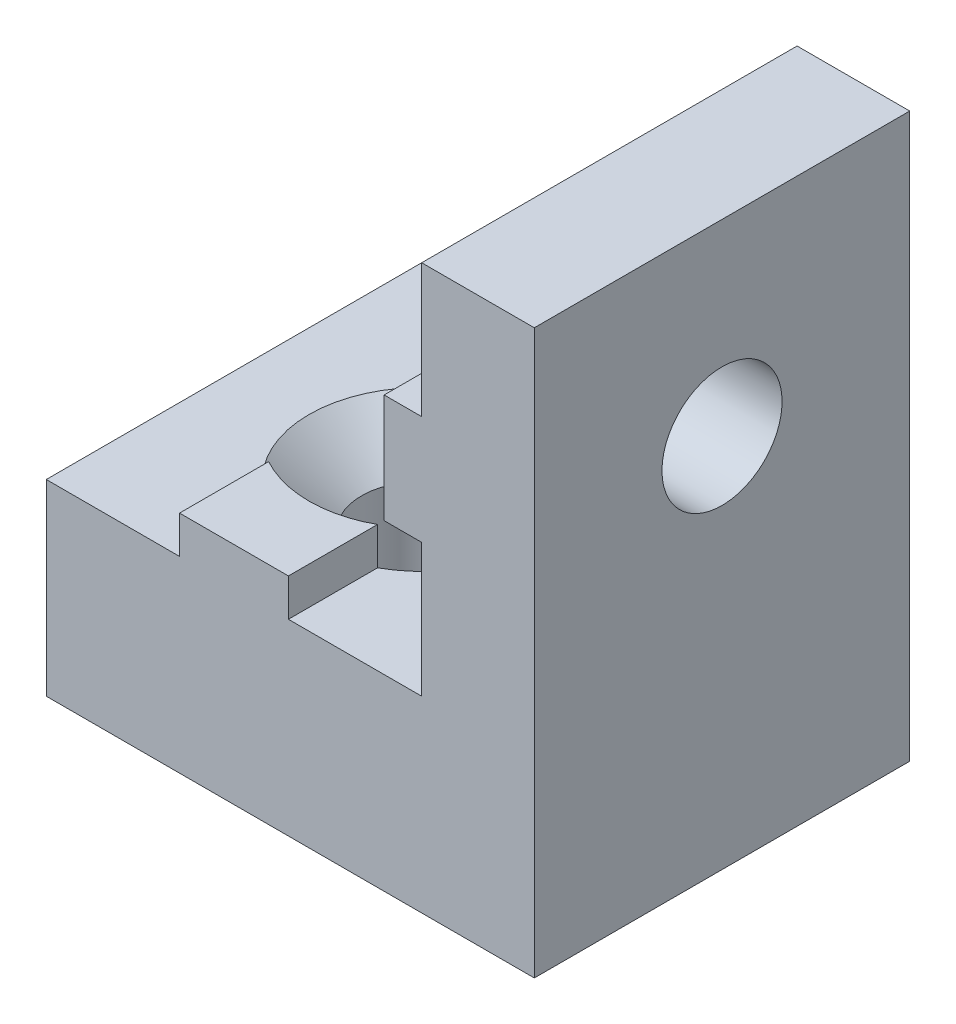
ISO-10303-21;
HEADER;
FILE_DESCRIPTION(('STEP AP214'),'2;1');
FILE_NAME('part.step','',(''),(''),'','','');
FILE_SCHEMA(('AUTOMOTIVE_DESIGN { 1 0 10303 214 1 1 1 1 }'));
ENDSEC;
DATA;
#1=APPLICATION_CONTEXT('core data for automotive mechanical design processes');
#2=APPLICATION_PROTOCOL_DEFINITION('international standard','automotive_design',2000,#1);
#3=PRODUCT_CONTEXT('',#1,'mechanical');
#4=PRODUCT('Part','Part','',(#3));
#5=PRODUCT_RELATED_PRODUCT_CATEGORY('part','',(#4));
#6=PRODUCT_DEFINITION_FORMATION('','',#4);
#7=PRODUCT_DEFINITION_CONTEXT('part definition',#1,'design');
#8=PRODUCT_DEFINITION('design','',#6,#7);
#9=PRODUCT_DEFINITION_SHAPE('','',#8);
#10=(LENGTH_UNIT() NAMED_UNIT(*) SI_UNIT(.MILLI.,.METRE.));
#11=(NAMED_UNIT(*) PLANE_ANGLE_UNIT() SI_UNIT($,.RADIAN.));
#12=(NAMED_UNIT(*) SI_UNIT($,.STERADIAN.) SOLID_ANGLE_UNIT());
#13=UNCERTAINTY_MEASURE_WITH_UNIT(LENGTH_MEASURE(1.E-05),#10,'distance_accuracy_value','');
#14=(GEOMETRIC_REPRESENTATION_CONTEXT(3) GLOBAL_UNCERTAINTY_ASSIGNED_CONTEXT((#13)) GLOBAL_UNIT_ASSIGNED_CONTEXT((#10,
#11,#12)) REPRESENTATION_CONTEXT('',''));
#15=CARTESIAN_POINT('',(0.,0.,0.));
#16=DIRECTION('',(0.,0.,1.));
#17=DIRECTION('',(1.,0.,0.));
#18=AXIS2_PLACEMENT_3D('',#15,#16,#17);
#19=CARTESIAN_POINT('',(9.,11.45,10.));
#20=DIRECTION('',(0.,-1.,0.));
#21=DIRECTION('',(0.,0.,-1.));
#22=AXIS2_PLACEMENT_3D('',#19,#20,#21);
#23=PLANE('',#22);
#24=DIRECTION('',(0.,0.,-1.));
#25=VECTOR('',#24,1.);
#26=CARTESIAN_POINT('',(10.,11.45,10.));
#27=LINE('',#26,#25);
#28=CARTESIAN_POINT('',(10.,11.45,10.));
#29=VERTEX_POINT('',#28);
#30=CARTESIAN_POINT('',(10.,11.45,5.67638746292344));
#31=VERTEX_POINT('',#30);
#32=EDGE_CURVE('E199',#29,#31,#27,.T.);
#33=ORIENTED_EDGE('',*,*,#32,.T.);
#34=DIRECTION('',(-1.,0.,0.));
#35=VECTOR('',#34,1.);
#36=CARTESIAN_POINT('',(13.,11.45,5.67638746292344));
#37=LINE('',#36,#35);
#38=CARTESIAN_POINT('',(9.,11.45,5.67638746292344));
#39=VERTEX_POINT('',#38);
#40=EDGE_CURVE('E182',#31,#39,#37,.T.);
#41=ORIENTED_EDGE('',*,*,#40,.T.);
#42=DIRECTION('',(0.,0.,-1.));
#43=VECTOR('',#42,1.);
#44=CARTESIAN_POINT('',(9.,11.45,10.));
#45=LINE('',#44,#43);
#46=CARTESIAN_POINT('',(9.,11.45,10.));
#47=VERTEX_POINT('',#46);
#48=EDGE_CURVE('E196',#47,#39,#45,.T.);
#49=ORIENTED_EDGE('',*,*,#48,.F.);
#50=DIRECTION('',(-1.,0.,0.));
#51=VECTOR('',#50,1.);
#52=CARTESIAN_POINT('',(9.,11.45,10.));
#53=LINE('',#52,#51);
#54=EDGE_CURVE('E357',#29,#47,#53,.T.);
#55=ORIENTED_EDGE('',*,*,#54,.F.);
#56=EDGE_LOOP('',(#33,#41,#49,#55));
#57=FACE_BOUND('',#56,.T.);
#58=ADVANCED_FACE('F33',(#57),#23,.F.);
#59=CARTESIAN_POINT('',(9.,8.55,10.));
#60=DIRECTION('',(1.,0.,0.));
#61=DIRECTION('',(0.,0.,-1.));
#62=AXIS2_PLACEMENT_3D('',#59,#60,#61);
#63=PLANE('',#62);
#64=ORIENTED_EDGE('',*,*,#48,.T.);
#65=CARTESIAN_POINT('',(9.,10.,5.));
#66=DIRECTION('',(-1.,0.,0.));
#67=DIRECTION('',(0.,0.,1.));
#68=AXIS2_PLACEMENT_3D('',#65,#66,#67);
#69=CIRCLE('',#68,1.6);
#70=CARTESIAN_POINT('',(9.,8.55,5.67638746292344));
#71=VERTEX_POINT('',#70);
#72=EDGE_CURVE('E179',#71,#39,#69,.T.);
#73=ORIENTED_EDGE('',*,*,#72,.F.);
#74=DIRECTION('',(0.,0.,-1.));
#75=VECTOR('',#74,1.);
#76=CARTESIAN_POINT('',(9.,8.55,10.));
#77=LINE('',#76,#75);
#78=CARTESIAN_POINT('',(9.,8.55,10.));
#79=VERTEX_POINT('',#78);
#80=EDGE_CURVE('E209',#79,#71,#77,.T.);
#81=ORIENTED_EDGE('',*,*,#80,.F.);
#82=DIRECTION('',(0.,-1.,0.));
#83=VECTOR('',#82,1.);
#84=CARTESIAN_POINT('',(9.,8.55,10.));
#85=LINE('',#84,#83);
#86=EDGE_CURVE('E204',#47,#79,#85,.T.);
#87=ORIENTED_EDGE('',*,*,#86,.F.);
#88=EDGE_LOOP('',(#64,#73,#81,#87));
#89=FACE_BOUND('',#88,.T.);
#90=ADVANCED_FACE('F203',(#89),#63,.F.);
#91=CARTESIAN_POINT('',(10.,8.55,10.));
#92=DIRECTION('',(0.,1.,0.));
#93=DIRECTION('',(-1.,0.,0.));
#94=AXIS2_PLACEMENT_3D('',#91,#92,#93);
#95=PLANE('',#94);
#96=DIRECTION('',(0.,0.,-1.));
#97=VECTOR('',#96,1.);
#98=CARTESIAN_POINT('',(10.,8.55,10.));
#99=LINE('',#98,#97);
#100=CARTESIAN_POINT('',(10.,8.55,4.32361253707656));
#101=VERTEX_POINT('',#100);
#102=CARTESIAN_POINT('',(10.,8.55,0.));
#103=VERTEX_POINT('',#102);
#104=EDGE_CURVE('E301',#101,#103,#99,.T.);
#105=ORIENTED_EDGE('',*,*,#104,.F.);
#106=DIRECTION('',(-1.,0.,0.));
#107=VECTOR('',#106,1.);
#108=CARTESIAN_POINT('',(13.,8.55000000000001,4.32361253707655));
#109=LINE('',#108,#107);
#110=CARTESIAN_POINT('',(9.,8.55,4.32361253707656));
#111=VERTEX_POINT('',#110);
#112=EDGE_CURVE('E48',#101,#111,#109,.T.);
#113=ORIENTED_EDGE('',*,*,#112,.T.);
#114=CARTESIAN_POINT('',(9.,8.55,0.));
#115=VERTEX_POINT('',#114);
#116=EDGE_CURVE('E304',#111,#115,#77,.T.);
#117=ORIENTED_EDGE('',*,*,#116,.T.);
#118=DIRECTION('',(1.,0.,0.));
#119=VECTOR('',#118,1.);
#120=CARTESIAN_POINT('',(10.,8.55,0.));
#121=LINE('',#120,#119);
#122=EDGE_CURVE('E262',#115,#103,#121,.T.);
#123=ORIENTED_EDGE('',*,*,#122,.T.);
#124=EDGE_LOOP('',(#105,#113,#117,#123));
#125=FACE_BOUND('',#124,.T.);
#126=ADVANCED_FACE('F314',(#125),#95,.F.);
#127=CARTESIAN_POINT('',(6.45,6.,10.));
#128=DIRECTION('',(-1.,0.,0.));
#129=DIRECTION('',(0.,-1.,0.));
#130=AXIS2_PLACEMENT_3D('',#127,#128,#129);
#131=PLANE('',#130);
#132=DIRECTION('',(0.,0.,-1.));
#133=VECTOR('',#132,1.);
#134=CARTESIAN_POINT('',(6.45,5.,10.));
#135=LINE('',#134,#133);
#136=CARTESIAN_POINT('',(6.45,5.,10.));
#137=VERTEX_POINT('',#136);
#138=CARTESIAN_POINT('',(6.45,5.,7.62630919733378));
#139=VERTEX_POINT('',#138);
#140=EDGE_CURVE('E296',#137,#139,#135,.T.);
#141=ORIENTED_EDGE('',*,*,#140,.T.);
#142=DIRECTION('',(0.,1.,0.));
#143=VECTOR('',#142,1.);
#144=CARTESIAN_POINT('',(6.44999999999999,-3.48528137423857,7.62630919733378));
#145=LINE('',#144,#143);
#146=CARTESIAN_POINT('',(6.45,6.,7.62630919733378));
#147=VERTEX_POINT('',#146);
#148=EDGE_CURVE('E380',#139,#147,#145,.T.);
#149=ORIENTED_EDGE('',*,*,#148,.T.);
#150=DIRECTION('',(0.,0.,-1.));
#151=VECTOR('',#150,1.);
#152=CARTESIAN_POINT('',(6.45,6.,10.));
#153=LINE('',#152,#151);
#154=CARTESIAN_POINT('',(6.45,6.,10.));
#155=VERTEX_POINT('',#154);
#156=EDGE_CURVE('E292',#155,#147,#153,.T.);
#157=ORIENTED_EDGE('',*,*,#156,.F.);
#158=DIRECTION('',(0.,1.,0.));
#159=VECTOR('',#158,1.);
#160=CARTESIAN_POINT('',(6.45,6.,10.));
#161=LINE('',#160,#159);
#162=EDGE_CURVE('E332',#137,#155,#161,.T.);
#163=ORIENTED_EDGE('',*,*,#162,.F.);
#164=EDGE_LOOP('',(#141,#149,#157,#163));
#165=FACE_BOUND('',#164,.T.);
#166=ADVANCED_FACE('F401',(#165),#131,.F.);
#167=CARTESIAN_POINT('',(3.55,6.,10.));
#168=DIRECTION('',(0.,-1.,0.));
#169=DIRECTION('',(1.,0.,0.));
#170=AXIS2_PLACEMENT_3D('',#167,#168,#169);
#171=PLANE('',#170);
#172=ORIENTED_EDGE('',*,*,#156,.T.);
#173=CARTESIAN_POINT('',(5.,6.,5.));
#174=DIRECTION('',(0.,1.,0.));
#175=DIRECTION('',(0.,0.,1.));
#176=AXIS2_PLACEMENT_3D('',#173,#174,#175);
#177=CIRCLE('',#176,3.);
#178=CARTESIAN_POINT('',(3.55,6.,7.62630919733378));
#179=VERTEX_POINT('',#178);
#180=EDGE_CURVE('E200',#179,#147,#177,.T.);
#181=ORIENTED_EDGE('',*,*,#180,.F.);
#182=DIRECTION('',(0.,0.,-1.));
#183=VECTOR('',#182,1.);
#184=CARTESIAN_POINT('',(3.55,6.,10.));
#185=LINE('',#184,#183);
#186=CARTESIAN_POINT('',(3.55,6.,10.));
#187=VERTEX_POINT('',#186);
#188=EDGE_CURVE('E288',#187,#179,#185,.T.);
#189=ORIENTED_EDGE('',*,*,#188,.F.);
#190=DIRECTION('',(-1.,0.,0.));
#191=VECTOR('',#190,1.);
#192=CARTESIAN_POINT('',(3.55,6.,10.));
#193=LINE('',#192,#191);
#194=EDGE_CURVE('E338',#155,#187,#193,.T.);
#195=ORIENTED_EDGE('',*,*,#194,.F.);
#196=EDGE_LOOP('',(#172,#181,#189,#195));
#197=FACE_BOUND('',#196,.T.);
#198=ADVANCED_FACE('F407',(#197),#171,.F.);
#199=CARTESIAN_POINT('',(3.55,5.,10.));
#200=DIRECTION('',(1.,0.,0.));
#201=DIRECTION('',(0.,1.,0.));
#202=AXIS2_PLACEMENT_3D('',#199,#200,#201);
#203=PLANE('',#202);
#204=DIRECTION('',(0.,0.,-1.));
#205=VECTOR('',#204,1.);
#206=CARTESIAN_POINT('',(3.55,5.,10.));
#207=LINE('',#206,#205);
#208=CARTESIAN_POINT('',(3.55,5.,2.37369080266622));
#209=VERTEX_POINT('',#208);
#210=CARTESIAN_POINT('',(3.55,5.,0.));
#211=VERTEX_POINT('',#210);
#212=EDGE_CURVE('E283',#209,#211,#207,.T.);
#213=ORIENTED_EDGE('',*,*,#212,.F.);
#214=DIRECTION('',(0.,1.,0.));
#215=VECTOR('',#214,1.);
#216=CARTESIAN_POINT('',(3.55,-3.48528137423857,2.37369080266622));
#217=LINE('',#216,#215);
#218=CARTESIAN_POINT('',(3.55,6.,2.37369080266622));
#219=VERTEX_POINT('',#218);
#220=EDGE_CURVE('E55',#209,#219,#217,.T.);
#221=ORIENTED_EDGE('',*,*,#220,.T.);
#222=CARTESIAN_POINT('',(3.55,6.,0.));
#223=VERTEX_POINT('',#222);
#224=EDGE_CURVE('E287',#219,#223,#185,.T.);
#225=ORIENTED_EDGE('',*,*,#224,.T.);
#226=DIRECTION('',(0.,-1.,0.));
#227=VECTOR('',#226,1.);
#228=CARTESIAN_POINT('',(3.55,5.,0.));
#229=LINE('',#228,#227);
#230=EDGE_CURVE('E276',#223,#211,#229,.T.);
#231=ORIENTED_EDGE('',*,*,#230,.T.);
#232=EDGE_LOOP('',(#213,#221,#225,#231));
#233=FACE_BOUND('',#232,.T.);
#234=ADVANCED_FACE('F413',(#233),#203,.F.);
#235=CARTESIAN_POINT('',(0.,5.,10.));
#236=DIRECTION('',(0.,-1.,0.));
#237=DIRECTION('',(0.,0.,-1.));
#238=AXIS2_PLACEMENT_3D('',#235,#236,#237);
#239=PLANE('',#238);
#240=CARTESIAN_POINT('',(5.,5.,5.));
#241=DIRECTION('',(0.,1.,0.));
#242=DIRECTION('',(0.,0.,1.));
#243=AXIS2_PLACEMENT_3D('',#240,#241,#242);
#244=CIRCLE('',#243,3.);
#245=CARTESIAN_POINT('',(3.55,5.,7.62630919733378));
#246=VERTEX_POINT('',#245);
#247=EDGE_CURVE('E410',#209,#246,#244,.T.);
#248=ORIENTED_EDGE('',*,*,#247,.F.);
#249=ORIENTED_EDGE('',*,*,#212,.T.);
#250=DIRECTION('',(-1.,0.,0.));
#251=VECTOR('',#250,1.);
#252=CARTESIAN_POINT('',(0.,5.,0.));
#253=LINE('',#252,#251);
#254=CARTESIAN_POINT('',(0.,5.,0.));
#255=VERTEX_POINT('',#254);
#256=EDGE_CURVE('E279',#211,#255,#253,.T.);
#257=ORIENTED_EDGE('',*,*,#256,.T.);
#258=DIRECTION('',(0.,0.,-1.));
#259=VECTOR('',#258,1.);
#260=CARTESIAN_POINT('',(0.,5.,10.));
#261=LINE('',#260,#259);
#262=CARTESIAN_POINT('',(0.,5.,10.));
#263=VERTEX_POINT('',#262);
#264=EDGE_CURVE('E236',#263,#255,#261,.T.);
#265=ORIENTED_EDGE('',*,*,#264,.F.);
#266=DIRECTION('',(-1.,0.,0.));
#267=VECTOR('',#266,1.);
#268=CARTESIAN_POINT('',(0.,5.,10.));
#269=LINE('',#268,#267);
#270=CARTESIAN_POINT('',(3.55,5.,10.));
#271=VERTEX_POINT('',#270);
#272=EDGE_CURVE('E247',#271,#263,#269,.T.);
#273=ORIENTED_EDGE('',*,*,#272,.F.);
#274=EDGE_CURVE('E284',#271,#246,#207,.T.);
#275=ORIENTED_EDGE('',*,*,#274,.T.);
#276=EDGE_LOOP('',(#248,#249,#257,#265,#273,#275));
#277=FACE_BOUND('',#276,.T.);
#278=ADVANCED_FACE('F346',(#277),#239,.F.);
#279=CARTESIAN_POINT('',(0.,0.,10.));
#280=DIRECTION('',(1.,0.,0.));
#281=DIRECTION('',(0.,0.,-1.));
#282=AXIS2_PLACEMENT_3D('',#279,#280,#281);
#283=PLANE('',#282);
#284=DIRECTION('',(0.,-1.,0.));
#285=VECTOR('',#284,1.);
#286=CARTESIAN_POINT('',(0.,0.,0.));
#287=LINE('',#286,#285);
#288=CARTESIAN_POINT('',(0.,0.,0.));
#289=VERTEX_POINT('',#288);
#290=EDGE_CURVE('E234',#255,#289,#287,.T.);
#291=ORIENTED_EDGE('',*,*,#290,.T.);
#292=DIRECTION('',(0.,0.,-1.));
#293=VECTOR('',#292,1.);
#294=CARTESIAN_POINT('',(0.,0.,10.));
#295=LINE('',#294,#293);
#296=CARTESIAN_POINT('',(0.,0.,10.));
#297=VERTEX_POINT('',#296);
#298=EDGE_CURVE('E41',#297,#289,#295,.T.);
#299=ORIENTED_EDGE('',*,*,#298,.F.);
#300=DIRECTION('',(0.,-1.,0.));
#301=VECTOR('',#300,1.);
#302=CARTESIAN_POINT('',(0.,0.,10.));
#303=LINE('',#302,#301);
#304=EDGE_CURVE('E281',#263,#297,#303,.T.);
#305=ORIENTED_EDGE('',*,*,#304,.F.);
#306=ORIENTED_EDGE('',*,*,#264,.T.);
#307=EDGE_LOOP('',(#291,#299,#305,#306));
#308=FACE_BOUND('',#307,.T.);
#309=ADVANCED_FACE('F35',(#308),#283,.F.);
#310=CARTESIAN_POINT('',(13.,0.,10.));
#311=DIRECTION('',(0.,1.,0.));
#312=DIRECTION('',(-1.,0.,0.));
#313=AXIS2_PLACEMENT_3D('',#310,#311,#312);
#314=PLANE('',#313);
#315=CARTESIAN_POINT('',(5.,0.,5.));
#316=DIRECTION('',(0.,1.,0.));
#317=DIRECTION('',(0.,0.,1.));
#318=AXIS2_PLACEMENT_3D('',#315,#316,#317);
#319=CIRCLE('',#318,1.6);
#320=CARTESIAN_POINT('',(5.,0.,6.6));
#321=VERTEX_POINT('',#320);
#322=EDGE_CURVE('E239',#321,#321,#319,.T.);
#323=ORIENTED_EDGE('',*,*,#322,.T.);
#324=EDGE_LOOP('',(#323));
#325=FACE_BOUND('',#324,.T.);
#326=DIRECTION('',(1.,0.,0.));
#327=VECTOR('',#326,1.);
#328=CARTESIAN_POINT('',(13.,0.,0.));
#329=LINE('',#328,#327);
#330=CARTESIAN_POINT('',(13.,0.,0.));
#331=VERTEX_POINT('',#330);
#332=EDGE_CURVE('E227',#289,#331,#329,.T.);
#333=ORIENTED_EDGE('',*,*,#332,.T.);
#334=DIRECTION('',(0.,0.,-1.));
#335=VECTOR('',#334,1.);
#336=CARTESIAN_POINT('',(13.,0.,10.));
#337=LINE('',#336,#335);
#338=CARTESIAN_POINT('',(13.,0.,10.));
#339=VERTEX_POINT('',#338);
#340=EDGE_CURVE('E219',#339,#331,#337,.T.);
#341=ORIENTED_EDGE('',*,*,#340,.F.);
#342=DIRECTION('',(1.,0.,0.));
#343=VECTOR('',#342,1.);
#344=CARTESIAN_POINT('',(13.,0.,10.));
#345=LINE('',#344,#343);
#346=EDGE_CURVE('E228',#297,#339,#345,.T.);
#347=ORIENTED_EDGE('',*,*,#346,.F.);
#348=ORIENTED_EDGE('',*,*,#298,.T.);
#349=EDGE_LOOP('',(#333,#341,#347,#348));
#350=FACE_BOUND('',#349,.T.);
#351=ADVANCED_FACE('F225',(#325,#350),#314,.F.);
#352=CARTESIAN_POINT('',(13.,15.,10.));
#353=DIRECTION('',(-1.,0.,0.));
#354=DIRECTION('',(0.,-1.,0.));
#355=AXIS2_PLACEMENT_3D('',#352,#353,#354);
#356=PLANE('',#355);
#357=CARTESIAN_POINT('',(13.,10.,5.));
#358=DIRECTION('',(-1.,0.,0.));
#359=DIRECTION('',(0.,0.,1.));
#360=AXIS2_PLACEMENT_3D('',#357,#358,#359);
#361=CIRCLE('',#360,1.6);
#362=CARTESIAN_POINT('',(13.,10.,6.6));
#363=VERTEX_POINT('',#362);
#364=EDGE_CURVE('E361',#363,#363,#361,.T.);
#365=ORIENTED_EDGE('',*,*,#364,.T.);
#366=EDGE_LOOP('',(#365));
#367=FACE_BOUND('',#366,.T.);
#368=DIRECTION('',(0.,1.,0.));
#369=VECTOR('',#368,1.);
#370=CARTESIAN_POINT('',(13.,15.,0.));
#371=LINE('',#370,#369);
#372=CARTESIAN_POINT('',(13.,15.,0.));
#373=VERTEX_POINT('',#372);
#374=EDGE_CURVE('E241',#331,#373,#371,.T.);
#375=ORIENTED_EDGE('',*,*,#374,.T.);
#376=DIRECTION('',(0.,0.,-1.));
#377=VECTOR('',#376,1.);
#378=CARTESIAN_POINT('',(13.,15.,10.));
#379=LINE('',#378,#377);
#380=CARTESIAN_POINT('',(13.,15.,10.));
#381=VERTEX_POINT('',#380);
#382=EDGE_CURVE('E216',#381,#373,#379,.T.);
#383=ORIENTED_EDGE('',*,*,#382,.F.);
#384=DIRECTION('',(0.,1.,0.));
#385=VECTOR('',#384,1.);
#386=CARTESIAN_POINT('',(13.,15.,10.));
#387=LINE('',#386,#385);
#388=EDGE_CURVE('E348',#339,#381,#387,.T.);
#389=ORIENTED_EDGE('',*,*,#388,.F.);
#390=ORIENTED_EDGE('',*,*,#340,.T.);
#391=EDGE_LOOP('',(#375,#383,#389,#390));
#392=FACE_BOUND('',#391,.T.);
#393=ADVANCED_FACE('F465',(#367,#392),#356,.F.);
#394=CARTESIAN_POINT('',(10.,15.,10.));
#395=DIRECTION('',(0.,-1.,0.));
#396=DIRECTION('',(0.,0.,-1.));
#397=AXIS2_PLACEMENT_3D('',#394,#395,#396);
#398=PLANE('',#397);
#399=DIRECTION('',(-1.,0.,0.));
#400=VECTOR('',#399,1.);
#401=CARTESIAN_POINT('',(10.,15.,0.));
#402=LINE('',#401,#400);
#403=CARTESIAN_POINT('',(10.,15.,0.));
#404=VERTEX_POINT('',#403);
#405=EDGE_CURVE('E251',#373,#404,#402,.T.);
#406=ORIENTED_EDGE('',*,*,#405,.T.);
#407=DIRECTION('',(0.,0.,-1.));
#408=VECTOR('',#407,1.);
#409=CARTESIAN_POINT('',(10.,15.,10.));
#410=LINE('',#409,#408);
#411=CARTESIAN_POINT('',(10.,15.,10.));
#412=VERTEX_POINT('',#411);
#413=EDGE_CURVE('E213',#412,#404,#410,.T.);
#414=ORIENTED_EDGE('',*,*,#413,.F.);
#415=DIRECTION('',(-1.,0.,0.));
#416=VECTOR('',#415,1.);
#417=CARTESIAN_POINT('',(10.,15.,10.));
#418=LINE('',#417,#416);
#419=EDGE_CURVE('E353',#381,#412,#418,.T.);
#420=ORIENTED_EDGE('',*,*,#419,.F.);
#421=ORIENTED_EDGE('',*,*,#382,.T.);
#422=EDGE_LOOP('',(#406,#414,#420,#421));
#423=FACE_BOUND('',#422,.T.);
#424=ADVANCED_FACE('F449',(#423),#398,.F.);
#425=CARTESIAN_POINT('',(10.,11.45,10.));
#426=DIRECTION('',(1.,0.,0.));
#427=DIRECTION('',(0.,0.,-1.));
#428=AXIS2_PLACEMENT_3D('',#425,#426,#427);
#429=PLANE('',#428);
#430=CARTESIAN_POINT('',(10.,11.45,4.32361253707656));
#431=VERTEX_POINT('',#430);
#432=CARTESIAN_POINT('',(10.,11.45,0.));
#433=VERTEX_POINT('',#432);
#434=EDGE_CURVE('E205',#431,#433,#27,.T.);
#435=ORIENTED_EDGE('',*,*,#434,.F.);
#436=CARTESIAN_POINT('',(10.,10.,5.));
#437=DIRECTION('',(1.,0.,0.));
#438=DIRECTION('',(0.,0.,-1.));
#439=AXIS2_PLACEMENT_3D('',#436,#437,#438);
#440=CIRCLE('',#439,1.6);
#441=EDGE_CURVE('E201',#431,#31,#440,.T.);
#442=ORIENTED_EDGE('',*,*,#441,.T.);
#443=ORIENTED_EDGE('',*,*,#32,.F.);
#444=DIRECTION('',(0.,-1.,0.));
#445=VECTOR('',#444,1.);
#446=CARTESIAN_POINT('',(10.,11.45,10.));
#447=LINE('',#446,#445);
#448=EDGE_CURVE('E355',#412,#29,#447,.T.);
#449=ORIENTED_EDGE('',*,*,#448,.F.);
#450=ORIENTED_EDGE('',*,*,#413,.T.);
#451=DIRECTION('',(0.,-1.,0.));
#452=VECTOR('',#451,1.);
#453=CARTESIAN_POINT('',(10.,11.45,0.));
#454=LINE('',#453,#452);
#455=EDGE_CURVE('E253',#404,#433,#454,.T.);
#456=ORIENTED_EDGE('',*,*,#455,.T.);
#457=EDGE_LOOP('',(#435,#442,#443,#449,#450,#456));
#458=FACE_BOUND('',#457,.T.);
#459=ADVANCED_FACE('F442',(#458),#429,.F.);
#460=CARTESIAN_POINT('',(9.,11.45,4.32361253707656));
#461=VERTEX_POINT('',#460);
#462=CARTESIAN_POINT('',(9.,11.45,0.));
#463=VERTEX_POINT('',#462);
#464=EDGE_CURVE('E206',#461,#463,#45,.T.);
#465=ORIENTED_EDGE('',*,*,#464,.F.);
#466=DIRECTION('',(-1.,0.,0.));
#467=VECTOR('',#466,1.);
#468=CARTESIAN_POINT('',(13.,11.45,4.32361253707656));
#469=LINE('',#468,#467);
#470=EDGE_CURVE('E363',#461,#431,#469,.F.);
#471=ORIENTED_EDGE('',*,*,#470,.T.);
#472=ORIENTED_EDGE('',*,*,#434,.T.);
#473=DIRECTION('',(-1.,0.,0.));
#474=VECTOR('',#473,1.);
#475=CARTESIAN_POINT('',(9.,11.45,0.));
#476=LINE('',#475,#474);
#477=EDGE_CURVE('E256',#433,#463,#476,.T.);
#478=ORIENTED_EDGE('',*,*,#477,.T.);
#479=EDGE_LOOP('',(#465,#471,#472,#478));
#480=FACE_BOUND('',#479,.T.);
#481=ADVANCED_FACE('F434',(#480),#23,.F.);
#482=ORIENTED_EDGE('',*,*,#116,.F.);
#483=EDGE_CURVE('E190',#461,#111,#69,.T.);
#484=ORIENTED_EDGE('',*,*,#483,.F.);
#485=ORIENTED_EDGE('',*,*,#464,.T.);
#486=DIRECTION('',(0.,-1.,0.));
#487=VECTOR('',#486,1.);
#488=CARTESIAN_POINT('',(9.,8.55,0.));
#489=LINE('',#488,#487);
#490=EDGE_CURVE('E259',#463,#115,#489,.T.);
#491=ORIENTED_EDGE('',*,*,#490,.T.);
#492=EDGE_LOOP('',(#482,#484,#485,#491));
#493=FACE_BOUND('',#492,.T.);
#494=ADVANCED_FACE('F439',(#493),#63,.F.);
#495=ORIENTED_EDGE('',*,*,#80,.T.);
#496=DIRECTION('',(-1.,0.,0.));
#497=VECTOR('',#496,1.);
#498=CARTESIAN_POINT('',(13.,8.55000000000001,5.67638746292345));
#499=LINE('',#498,#497);
#500=CARTESIAN_POINT('',(10.,8.55,5.67638746292344));
#501=VERTEX_POINT('',#500);
#502=EDGE_CURVE('E185',#71,#501,#499,.F.);
#503=ORIENTED_EDGE('',*,*,#502,.T.);
#504=CARTESIAN_POINT('',(10.,8.55,10.));
#505=VERTEX_POINT('',#504);
#506=EDGE_CURVE('E302',#505,#501,#99,.T.);
#507=ORIENTED_EDGE('',*,*,#506,.F.);
#508=DIRECTION('',(1.,0.,0.));
#509=VECTOR('',#508,1.);
#510=CARTESIAN_POINT('',(10.,8.55,10.));
#511=LINE('',#510,#509);
#512=EDGE_CURVE('E330',#79,#505,#511,.T.);
#513=ORIENTED_EDGE('',*,*,#512,.F.);
#514=EDGE_LOOP('',(#495,#503,#507,#513));
#515=FACE_BOUND('',#514,.T.);
#516=ADVANCED_FACE('F360',(#515),#95,.F.);
#517=CARTESIAN_POINT('',(10.,5.,10.));
#518=DIRECTION('',(1.,0.,0.));
#519=DIRECTION('',(0.,0.,-1.));
#520=AXIS2_PLACEMENT_3D('',#517,#518,#519);
#521=PLANE('',#520);
#522=ORIENTED_EDGE('',*,*,#506,.T.);
#523=CARTESIAN_POINT('',(10.,10.,5.));
#524=DIRECTION('',(1.,0.,0.));
#525=DIRECTION('',(0.,0.,-1.));
#526=AXIS2_PLACEMENT_3D('',#523,#524,#525);
#527=CIRCLE('',#526,1.6);
#528=EDGE_CURVE('E11',#501,#101,#527,.T.);
#529=ORIENTED_EDGE('',*,*,#528,.T.);
#530=ORIENTED_EDGE('',*,*,#104,.T.);
#531=DIRECTION('',(0.,-1.,0.));
#532=VECTOR('',#531,1.);
#533=CARTESIAN_POINT('',(10.,5.,0.));
#534=LINE('',#533,#532);
#535=CARTESIAN_POINT('',(10.,5.,0.));
#536=VERTEX_POINT('',#535);
#537=EDGE_CURVE('E265',#103,#536,#534,.T.);
#538=ORIENTED_EDGE('',*,*,#537,.T.);
#539=DIRECTION('',(0.,0.,-1.));
#540=VECTOR('',#539,1.);
#541=CARTESIAN_POINT('',(10.,5.,10.));
#542=LINE('',#541,#540);
#543=CARTESIAN_POINT('',(10.,5.,10.));
#544=VERTEX_POINT('',#543);
#545=EDGE_CURVE('E299',#544,#536,#542,.T.);
#546=ORIENTED_EDGE('',*,*,#545,.F.);
#547=DIRECTION('',(0.,-1.,0.));
#548=VECTOR('',#547,1.);
#549=CARTESIAN_POINT('',(10.,5.,10.));
#550=LINE('',#549,#548);
#551=EDGE_CURVE('E328',#505,#544,#550,.T.);
#552=ORIENTED_EDGE('',*,*,#551,.F.);
#553=EDGE_LOOP('',(#522,#529,#530,#538,#546,#552));
#554=FACE_BOUND('',#553,.T.);
#555=ADVANCED_FACE('F309',(#554),#521,.F.);
#556=CARTESIAN_POINT('',(6.45,5.,10.));
#557=DIRECTION('',(0.,-1.,0.));
#558=DIRECTION('',(0.,0.,-1.));
#559=AXIS2_PLACEMENT_3D('',#556,#557,#558);
#560=PLANE('',#559);
#561=CARTESIAN_POINT('',(6.45,5.,2.37369080266622));
#562=VERTEX_POINT('',#561);
#563=CARTESIAN_POINT('',(6.45,5.,0.));
#564=VERTEX_POINT('',#563);
#565=EDGE_CURVE('E295',#562,#564,#135,.T.);
#566=ORIENTED_EDGE('',*,*,#565,.F.);
#567=EDGE_CURVE('E384',#139,#562,#244,.T.);
#568=ORIENTED_EDGE('',*,*,#567,.F.);
#569=ORIENTED_EDGE('',*,*,#140,.F.);
#570=DIRECTION('',(-1.,0.,0.));
#571=VECTOR('',#570,1.);
#572=CARTESIAN_POINT('',(6.45,5.,10.));
#573=LINE('',#572,#571);
#574=EDGE_CURVE('E327',#544,#137,#573,.T.);
#575=ORIENTED_EDGE('',*,*,#574,.F.);
#576=ORIENTED_EDGE('',*,*,#545,.T.);
#577=DIRECTION('',(-1.,0.,0.));
#578=VECTOR('',#577,1.);
#579=CARTESIAN_POINT('',(6.45,5.,0.));
#580=LINE('',#579,#578);
#581=EDGE_CURVE('E267',#536,#564,#580,.T.);
#582=ORIENTED_EDGE('',*,*,#581,.T.);
#583=EDGE_LOOP('',(#566,#568,#569,#575,#576,#582));
#584=FACE_BOUND('',#583,.T.);
#585=ADVANCED_FACE('F323',(#584),#560,.F.);
#586=CARTESIAN_POINT('',(6.45,6.,2.37369080266622));
#587=VERTEX_POINT('',#586);
#588=CARTESIAN_POINT('',(6.45,6.,0.));
#589=VERTEX_POINT('',#588);
#590=EDGE_CURVE('E291',#587,#589,#153,.T.);
#591=ORIENTED_EDGE('',*,*,#590,.F.);
#592=DIRECTION('',(0.,1.,0.));
#593=VECTOR('',#592,1.);
#594=CARTESIAN_POINT('',(6.44999999999999,-3.48528137423857,2.37369080266622));
#595=LINE('',#594,#593);
#596=EDGE_CURVE('E377',#587,#562,#595,.F.);
#597=ORIENTED_EDGE('',*,*,#596,.T.);
#598=ORIENTED_EDGE('',*,*,#565,.T.);
#599=DIRECTION('',(0.,1.,0.));
#600=VECTOR('',#599,1.);
#601=CARTESIAN_POINT('',(6.45,6.,0.));
#602=LINE('',#601,#600);
#603=EDGE_CURVE('E270',#564,#589,#602,.T.);
#604=ORIENTED_EDGE('',*,*,#603,.T.);
#605=EDGE_LOOP('',(#591,#597,#598,#604));
#606=FACE_BOUND('',#605,.T.);
#607=ADVANCED_FACE('F421',(#606),#131,.F.);
#608=ORIENTED_EDGE('',*,*,#224,.F.);
#609=EDGE_CURVE('E372',#587,#219,#177,.T.);
#610=ORIENTED_EDGE('',*,*,#609,.F.);
#611=ORIENTED_EDGE('',*,*,#590,.T.);
#612=DIRECTION('',(-1.,0.,0.));
#613=VECTOR('',#612,1.);
#614=CARTESIAN_POINT('',(3.55,6.,0.));
#615=LINE('',#614,#613);
#616=EDGE_CURVE('E273',#589,#223,#615,.T.);
#617=ORIENTED_EDGE('',*,*,#616,.T.);
#618=EDGE_LOOP('',(#608,#610,#611,#617));
#619=FACE_BOUND('',#618,.T.);
#620=ADVANCED_FACE('F417',(#619),#171,.F.);
#621=ORIENTED_EDGE('',*,*,#188,.T.);
#622=DIRECTION('',(0.,1.,0.));
#623=VECTOR('',#622,1.);
#624=CARTESIAN_POINT('',(3.55,-3.48528137423857,7.62630919733378));
#625=LINE('',#624,#623);
#626=EDGE_CURVE('E373',#179,#246,#625,.F.);
#627=ORIENTED_EDGE('',*,*,#626,.T.);
#628=ORIENTED_EDGE('',*,*,#274,.F.);
#629=DIRECTION('',(0.,-1.,0.));
#630=VECTOR('',#629,1.);
#631=CARTESIAN_POINT('',(3.55,5.,10.));
#632=LINE('',#631,#630);
#633=EDGE_CURVE('E339',#187,#271,#632,.T.);
#634=ORIENTED_EDGE('',*,*,#633,.F.);
#635=EDGE_LOOP('',(#621,#627,#628,#634));
#636=FACE_BOUND('',#635,.T.);
#637=ADVANCED_FACE('F409',(#636),#203,.F.);
#638=CARTESIAN_POINT('',(0.,0.,10.));
#639=DIRECTION('',(0.,0.,-1.));
#640=DIRECTION('',(-1.,0.,0.));
#641=AXIS2_PLACEMENT_3D('',#638,#639,#640);
#642=PLANE('',#641);
#643=ORIENTED_EDGE('',*,*,#304,.T.);
#644=ORIENTED_EDGE('',*,*,#346,.T.);
#645=ORIENTED_EDGE('',*,*,#388,.T.);
#646=ORIENTED_EDGE('',*,*,#419,.T.);
#647=ORIENTED_EDGE('',*,*,#448,.T.);
#648=ORIENTED_EDGE('',*,*,#54,.T.);
#649=ORIENTED_EDGE('',*,*,#86,.T.);
#650=ORIENTED_EDGE('',*,*,#512,.T.);
#651=ORIENTED_EDGE('',*,*,#551,.T.);
#652=ORIENTED_EDGE('',*,*,#574,.T.);
#653=ORIENTED_EDGE('',*,*,#162,.T.);
#654=ORIENTED_EDGE('',*,*,#194,.T.);
#655=ORIENTED_EDGE('',*,*,#633,.T.);
#656=ORIENTED_EDGE('',*,*,#272,.T.);
#657=EDGE_LOOP('',(#643,#644,#645,#646,#647,#648,#649,#650,#651,#652,#653,#654,#655,#656));
#658=FACE_BOUND('',#657,.T.);
#659=ADVANCED_FACE('F343',(#658),#642,.F.);
#660=CARTESIAN_POINT('',(0.,0.,0.));
#661=DIRECTION('',(0.,0.,-1.));
#662=DIRECTION('',(-1.,0.,0.));
#663=AXIS2_PLACEMENT_3D('',#660,#661,#662);
#664=PLANE('',#663);
#665=ORIENTED_EDGE('',*,*,#290,.F.);
#666=ORIENTED_EDGE('',*,*,#256,.F.);
#667=ORIENTED_EDGE('',*,*,#230,.F.);
#668=ORIENTED_EDGE('',*,*,#616,.F.);
#669=ORIENTED_EDGE('',*,*,#603,.F.);
#670=ORIENTED_EDGE('',*,*,#581,.F.);
#671=ORIENTED_EDGE('',*,*,#537,.F.);
#672=ORIENTED_EDGE('',*,*,#122,.F.);
#673=ORIENTED_EDGE('',*,*,#490,.F.);
#674=ORIENTED_EDGE('',*,*,#477,.F.);
#675=ORIENTED_EDGE('',*,*,#455,.F.);
#676=ORIENTED_EDGE('',*,*,#405,.F.);
#677=ORIENTED_EDGE('',*,*,#374,.F.);
#678=ORIENTED_EDGE('',*,*,#332,.F.);
#679=EDGE_LOOP('',(#665,#666,#667,#668,#669,#670,#671,#672,#673,#674,#675,#676,#677,#678));
#680=FACE_BOUND('',#679,.T.);
#681=ADVANCED_FACE('F318',(#680),#664,.T.);
#682=CARTESIAN_POINT('',(5.,5.,5.));
#683=DIRECTION('',(0.,1.,0.));
#684=DIRECTION('',(0.,0.,1.));
#685=AXIS2_PLACEMENT_3D('',#682,#683,#684);
#686=CYLINDRICAL_SURFACE('',#685,1.6);
#687=ORIENTED_EDGE('',*,*,#322,.F.);
#688=EDGE_LOOP('',(#687));
#689=FACE_BOUND('',#688,.T.);
#690=CARTESIAN_POINT('',(5.,3.82526051635181,5.));
#691=DIRECTION('',(0.,1.,0.));
#692=DIRECTION('',(0.,0.,1.));
#693=AXIS2_PLACEMENT_3D('',#690,#691,#692);
#694=CIRCLE('',#693,1.6);
#695=CARTESIAN_POINT('',(5.,3.82526051635181,6.6));
#696=VERTEX_POINT('',#695);
#697=EDGE_CURVE('E244',#696,#696,#694,.T.);
#698=ORIENTED_EDGE('',*,*,#697,.T.);
#699=EDGE_LOOP('',(#698));
#700=FACE_BOUND('',#699,.T.);
#701=ADVANCED_FACE('F390',(#689,#700),#686,.F.);
#702=CARTESIAN_POINT('',(5.,5.,5.));
#703=DIRECTION('',(0.,1.,0.));
#704=DIRECTION('',(0.,0.,1.));
#705=AXIS2_PLACEMENT_3D('',#702,#703,#704);
#706=CONICAL_SURFACE('',#705,3.,0.872664625997165);
#707=ORIENTED_EDGE('',*,*,#697,.F.);
#708=EDGE_LOOP('',(#707));
#709=FACE_BOUND('',#708,.T.);
#710=ORIENTED_EDGE('',*,*,#567,.T.);
#711=EDGE_CURVE('E386',#562,#209,#244,.T.);
#712=ORIENTED_EDGE('',*,*,#711,.T.);
#713=ORIENTED_EDGE('',*,*,#247,.T.);
#714=EDGE_CURVE('E383',#246,#139,#244,.T.);
#715=ORIENTED_EDGE('',*,*,#714,.T.);
#716=EDGE_LOOP('',(#710,#712,#713,#715));
#717=FACE_BOUND('',#716,.T.);
#718=ADVANCED_FACE('F392',(#709,#717),#706,.F.);
#719=CARTESIAN_POINT('',(5.,-3.48528137423857,5.));
#720=DIRECTION('',(0.,1.,0.));
#721=DIRECTION('',(0.,0.,1.));
#722=AXIS2_PLACEMENT_3D('',#719,#720,#721);
#723=CYLINDRICAL_SURFACE('',#722,3.);
#724=ORIENTED_EDGE('',*,*,#714,.F.);
#725=ORIENTED_EDGE('',*,*,#626,.F.);
#726=ORIENTED_EDGE('',*,*,#180,.T.);
#727=ORIENTED_EDGE('',*,*,#148,.F.);
#728=EDGE_LOOP('',(#724,#725,#726,#727));
#729=FACE_BOUND('',#728,.T.);
#730=ADVANCED_FACE('F395',(#729),#723,.F.);
#731=ORIENTED_EDGE('',*,*,#609,.T.);
#732=ORIENTED_EDGE('',*,*,#220,.F.);
#733=ORIENTED_EDGE('',*,*,#711,.F.);
#734=ORIENTED_EDGE('',*,*,#596,.F.);
#735=EDGE_LOOP('',(#731,#732,#733,#734));
#736=FACE_BOUND('',#735,.T.);
#737=ADVANCED_FACE('F422',(#736),#723,.F.);
#738=CARTESIAN_POINT('',(13.,10.,5.));
#739=DIRECTION('',(-1.,0.,0.));
#740=DIRECTION('',(0.,0.,1.));
#741=AXIS2_PLACEMENT_3D('',#738,#739,#740);
#742=CYLINDRICAL_SURFACE('',#741,1.6);
#743=ORIENTED_EDGE('',*,*,#364,.F.);
#744=EDGE_LOOP('',(#743));
#745=FACE_BOUND('',#744,.T.);
#746=ORIENTED_EDGE('',*,*,#441,.F.);
#747=ORIENTED_EDGE('',*,*,#470,.F.);
#748=ORIENTED_EDGE('',*,*,#483,.T.);
#749=ORIENTED_EDGE('',*,*,#112,.F.);
#750=ORIENTED_EDGE('',*,*,#528,.F.);
#751=ORIENTED_EDGE('',*,*,#502,.F.);
#752=ORIENTED_EDGE('',*,*,#72,.T.);
#753=ORIENTED_EDGE('',*,*,#40,.F.);
#754=EDGE_LOOP('',(#746,#747,#748,#749,#750,#751,#752,#753));
#755=FACE_BOUND('',#754,.T.);
#756=ADVANCED_FACE('F181',(#745,#755),#742,.F.);
#757=CLOSED_SHELL('',(#58,#90,#126,#166,#198,#234,#278,#309,#351,#393,#424,#459,#481,#494,#516,
#555,#585,#607,#620,#637,#659,#681,#701,#718,#730,#737,#756));
#758=MANIFOLD_SOLID_BREP('B2',#757);
#759=ADVANCED_BREP_SHAPE_REPRESENTATION('',(#18,#758),#14);
#760=SHAPE_DEFINITION_REPRESENTATION(#9,#759);
ENDSEC;
END-ISO-10303-21;
